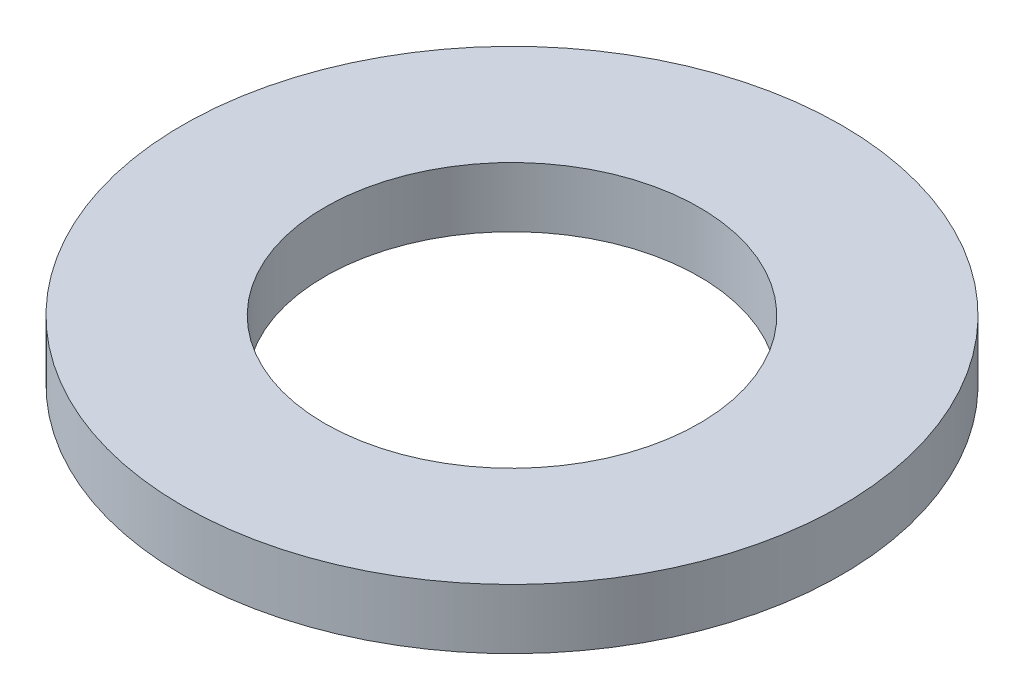
ISO-10303-21;
HEADER;
FILE_DESCRIPTION(('STEP AP214'),'2;1');
FILE_NAME('part.step','',(''),(''),'','','');
FILE_SCHEMA(('AUTOMOTIVE_DESIGN { 1 0 10303 214 1 1 1 1 }'));
ENDSEC;
DATA;
#1=APPLICATION_CONTEXT('core data for automotive mechanical design processes');
#2=APPLICATION_PROTOCOL_DEFINITION('international standard','automotive_design',2000,#1);
#3=PRODUCT_CONTEXT('',#1,'mechanical');
#4=PRODUCT('Part','Part','',(#3));
#5=PRODUCT_RELATED_PRODUCT_CATEGORY('part','',(#4));
#6=PRODUCT_DEFINITION_FORMATION('','',#4);
#7=PRODUCT_DEFINITION_CONTEXT('part definition',#1,'design');
#8=PRODUCT_DEFINITION('design','',#6,#7);
#9=PRODUCT_DEFINITION_SHAPE('','',#8);
#10=(LENGTH_UNIT() NAMED_UNIT(*) SI_UNIT(.MILLI.,.METRE.));
#11=(NAMED_UNIT(*) PLANE_ANGLE_UNIT() SI_UNIT($,.RADIAN.));
#12=(NAMED_UNIT(*) SI_UNIT($,.STERADIAN.) SOLID_ANGLE_UNIT());
#13=UNCERTAINTY_MEASURE_WITH_UNIT(LENGTH_MEASURE(1.E-05),#10,'distance_accuracy_value','');
#14=(GEOMETRIC_REPRESENTATION_CONTEXT(3) GLOBAL_UNCERTAINTY_ASSIGNED_CONTEXT((#13)) GLOBAL_UNIT_ASSIGNED_CONTEXT((#10,
#11,#12)) REPRESENTATION_CONTEXT('',''));
#15=CARTESIAN_POINT('',(0.,0.,0.));
#16=DIRECTION('',(0.,0.,1.));
#17=DIRECTION('',(1.,0.,0.));
#18=AXIS2_PLACEMENT_3D('',#15,#16,#17);
#19=CARTESIAN_POINT('',(0.,4.,0.));
#20=DIRECTION('',(0.,1.,0.));
#21=DIRECTION('',(0.,0.,1.));
#22=AXIS2_PLACEMENT_3D('',#19,#20,#21);
#23=PLANE('',#22);
#24=CARTESIAN_POINT('',(0.,4.,0.));
#25=DIRECTION('',(0.,1.,0.));
#26=DIRECTION('',(0.,0.,1.));
#27=AXIS2_PLACEMENT_3D('',#24,#25,#26);
#28=CIRCLE('',#27,22.);
#29=CARTESIAN_POINT('',(0.,4.,22.));
#30=VERTEX_POINT('',#29);
#31=EDGE_CURVE('E10',#30,#30,#28,.T.);
#32=ORIENTED_EDGE('',*,*,#31,.T.);
#33=EDGE_LOOP('',(#32));
#34=FACE_BOUND('',#33,.T.);
#35=CARTESIAN_POINT('',(0.,4.,0.));
#36=DIRECTION('',(0.,1.,0.));
#37=DIRECTION('',(0.,0.,1.));
#38=AXIS2_PLACEMENT_3D('',#35,#36,#37);
#39=CIRCLE('',#38,12.5);
#40=CARTESIAN_POINT('',(0.,4.,12.5));
#41=VERTEX_POINT('',#40);
#42=EDGE_CURVE('E42',#41,#41,#39,.T.);
#43=ORIENTED_EDGE('',*,*,#42,.F.);
#44=EDGE_LOOP('',(#43));
#45=FACE_BOUND('',#44,.T.);
#46=ADVANCED_FACE('F31',(#34,#45),#23,.T.);
#47=CARTESIAN_POINT('',(0.,0.,0.));
#48=DIRECTION('',(0.,1.,0.));
#49=DIRECTION('',(0.,0.,1.));
#50=AXIS2_PLACEMENT_3D('',#47,#48,#49);
#51=PLANE('',#50);
#52=CARTESIAN_POINT('',(0.,0.,0.));
#53=DIRECTION('',(0.,1.,0.));
#54=DIRECTION('',(0.,0.,1.));
#55=AXIS2_PLACEMENT_3D('',#52,#53,#54);
#56=CIRCLE('',#55,22.);
#57=CARTESIAN_POINT('',(0.,0.,22.));
#58=VERTEX_POINT('',#57);
#59=EDGE_CURVE('E35',#58,#58,#56,.T.);
#60=ORIENTED_EDGE('',*,*,#59,.F.);
#61=EDGE_LOOP('',(#60));
#62=FACE_BOUND('',#61,.T.);
#63=CARTESIAN_POINT('',(0.,0.,0.));
#64=DIRECTION('',(0.,1.,0.));
#65=DIRECTION('',(0.,0.,1.));
#66=AXIS2_PLACEMENT_3D('',#63,#64,#65);
#67=CIRCLE('',#66,12.5);
#68=CARTESIAN_POINT('',(0.,0.,12.5));
#69=VERTEX_POINT('',#68);
#70=EDGE_CURVE('E44',#69,#69,#67,.T.);
#71=ORIENTED_EDGE('',*,*,#70,.T.);
#72=EDGE_LOOP('',(#71));
#73=FACE_BOUND('',#72,.T.);
#74=ADVANCED_FACE('F54',(#62,#73),#51,.F.);
#75=CARTESIAN_POINT('',(0.,4.,0.));
#76=DIRECTION('',(0.,-1.,0.));
#77=DIRECTION('',(0.,0.,-1.));
#78=AXIS2_PLACEMENT_3D('',#75,#76,#77);
#79=CYLINDRICAL_SURFACE('',#78,22.);
#80=ORIENTED_EDGE('',*,*,#31,.F.);
#81=EDGE_LOOP('',(#80));
#82=FACE_BOUND('',#81,.T.);
#83=ORIENTED_EDGE('',*,*,#59,.T.);
#84=EDGE_LOOP('',(#83));
#85=FACE_BOUND('',#84,.T.);
#86=ADVANCED_FACE('F33',(#82,#85),#79,.T.);
#87=CARTESIAN_POINT('',(0.,4.,0.));
#88=DIRECTION('',(0.,-1.,0.));
#89=DIRECTION('',(0.,0.,-1.));
#90=AXIS2_PLACEMENT_3D('',#87,#88,#89);
#91=CYLINDRICAL_SURFACE('',#90,12.5);
#92=ORIENTED_EDGE('',*,*,#42,.T.);
#93=EDGE_LOOP('',(#92));
#94=FACE_BOUND('',#93,.T.);
#95=ORIENTED_EDGE('',*,*,#70,.F.);
#96=EDGE_LOOP('',(#95));
#97=FACE_BOUND('',#96,.T.);
#98=ADVANCED_FACE('F50',(#94,#97),#91,.F.);
#99=CLOSED_SHELL('',(#46,#74,#86,#98));
#100=MANIFOLD_SOLID_BREP('B2',#99);
#101=ADVANCED_BREP_SHAPE_REPRESENTATION('',(#18,#100),#14);
#102=SHAPE_DEFINITION_REPRESENTATION(#9,#101);
ENDSEC;
END-ISO-10303-21;
